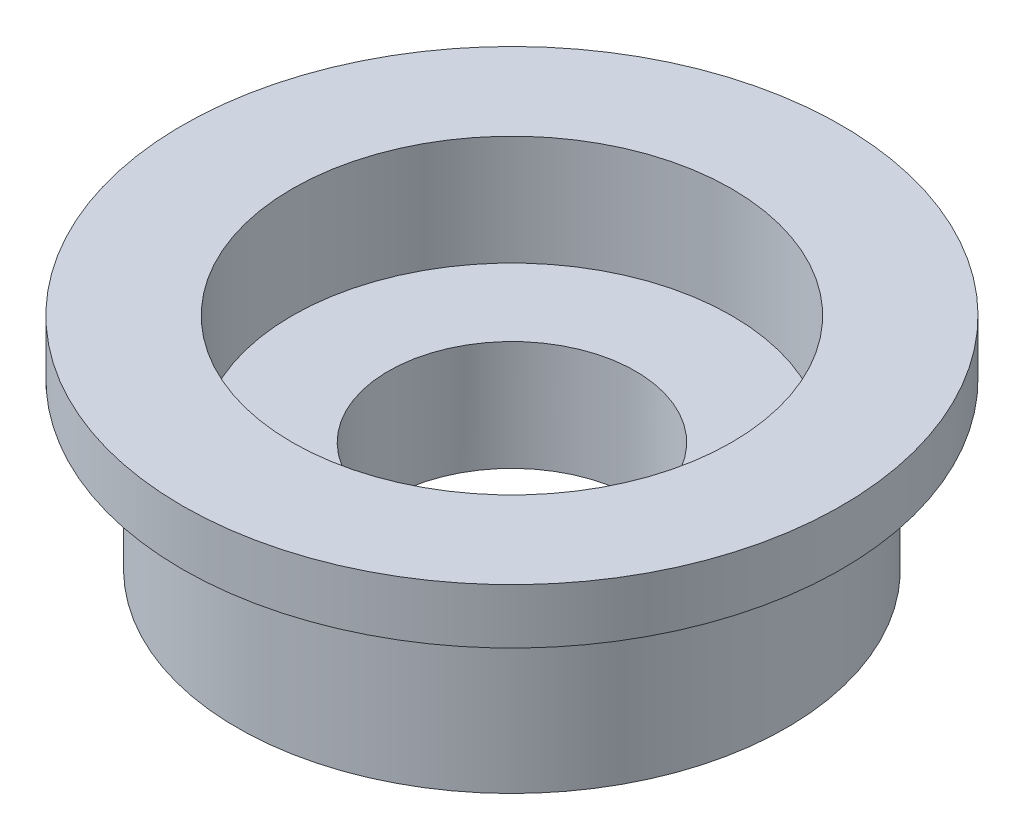
ISO-10303-21;
HEADER;
FILE_DESCRIPTION(('STEP AP214'),'2;1');
FILE_NAME('part.step','',(''),(''),'','','');
FILE_SCHEMA(('AUTOMOTIVE_DESIGN { 1 0 10303 214 1 1 1 1 }'));
ENDSEC;
DATA;
#1=APPLICATION_CONTEXT('core data for automotive mechanical design processes');
#2=APPLICATION_PROTOCOL_DEFINITION('international standard','automotive_design',2000,#1);
#3=PRODUCT_CONTEXT('',#1,'mechanical');
#4=PRODUCT('Part','Part','',(#3));
#5=PRODUCT_RELATED_PRODUCT_CATEGORY('part','',(#4));
#6=PRODUCT_DEFINITION_FORMATION('','',#4);
#7=PRODUCT_DEFINITION_CONTEXT('part definition',#1,'design');
#8=PRODUCT_DEFINITION('design','',#6,#7);
#9=PRODUCT_DEFINITION_SHAPE('','',#8);
#10=(LENGTH_UNIT() NAMED_UNIT(*) SI_UNIT(.MILLI.,.METRE.));
#11=(NAMED_UNIT(*) PLANE_ANGLE_UNIT() SI_UNIT($,.RADIAN.));
#12=(NAMED_UNIT(*) SI_UNIT($,.STERADIAN.) SOLID_ANGLE_UNIT());
#13=UNCERTAINTY_MEASURE_WITH_UNIT(LENGTH_MEASURE(1.E-05),#10,'distance_accuracy_value','');
#14=(GEOMETRIC_REPRESENTATION_CONTEXT(3) GLOBAL_UNCERTAINTY_ASSIGNED_CONTEXT((#13)) GLOBAL_UNIT_ASSIGNED_CONTEXT((#10,
#11,#12)) REPRESENTATION_CONTEXT('',''));
#15=CARTESIAN_POINT('',(0.,0.,0.));
#16=DIRECTION('',(0.,0.,1.));
#17=DIRECTION('',(1.,0.,0.));
#18=AXIS2_PLACEMENT_3D('',#15,#16,#17);
#19=CARTESIAN_POINT('',(0.,1.,0.));
#20=DIRECTION('',(0.,-1.,0.));
#21=DIRECTION('',(0.,0.,-1.));
#22=AXIS2_PLACEMENT_3D('',#19,#20,#21);
#23=CYLINDRICAL_SURFACE('',#22,6.);
#24=CARTESIAN_POINT('',(0.,1.,0.));
#25=DIRECTION('',(0.,1.,0.));
#26=DIRECTION('',(0.,0.,1.));
#27=AXIS2_PLACEMENT_3D('',#24,#25,#26);
#28=CIRCLE('',#27,6.);
#29=CARTESIAN_POINT('',(0.,1.,6.));
#30=VERTEX_POINT('',#29);
#31=EDGE_CURVE('E44',#30,#30,#28,.T.);
#32=ORIENTED_EDGE('',*,*,#31,.F.);
#33=EDGE_LOOP('',(#32));
#34=FACE_BOUND('',#33,.T.);
#35=CARTESIAN_POINT('',(0.,0.,0.));
#36=DIRECTION('',(0.,1.,0.));
#37=DIRECTION('',(0.,0.,1.));
#38=AXIS2_PLACEMENT_3D('',#35,#36,#37);
#39=CIRCLE('',#38,6.);
#40=CARTESIAN_POINT('',(0.,0.,6.));
#41=VERTEX_POINT('',#40);
#42=EDGE_CURVE('E50',#41,#41,#39,.T.);
#43=ORIENTED_EDGE('',*,*,#42,.T.);
#44=EDGE_LOOP('',(#43));
#45=FACE_BOUND('',#44,.T.);
#46=ADVANCED_FACE('F36',(#34,#45),#23,.T.);
#47=CARTESIAN_POINT('',(0.,1.,0.));
#48=DIRECTION('',(0.,1.,0.));
#49=DIRECTION('',(0.,0.,1.));
#50=AXIS2_PLACEMENT_3D('',#47,#48,#49);
#51=PLANE('',#50);
#52=CARTESIAN_POINT('',(0.,1.,0.));
#53=DIRECTION('',(0.,1.,0.));
#54=DIRECTION('',(0.,0.,1.));
#55=AXIS2_PLACEMENT_3D('',#52,#53,#54);
#56=CIRCLE('',#55,4.);
#57=CARTESIAN_POINT('',(0.,1.,4.));
#58=VERTEX_POINT('',#57);
#59=EDGE_CURVE('E66',#58,#58,#56,.T.);
#60=ORIENTED_EDGE('',*,*,#59,.F.);
#61=EDGE_LOOP('',(#60));
#62=FACE_BOUND('',#61,.T.);
#63=ORIENTED_EDGE('',*,*,#31,.T.);
#64=EDGE_LOOP('',(#63));
#65=FACE_BOUND('',#64,.T.);
#66=ADVANCED_FACE('F102',(#62,#65),#51,.T.);
#67=CARTESIAN_POINT('',(0.,0.,0.));
#68=DIRECTION('',(0.,1.,0.));
#69=DIRECTION('',(0.,0.,1.));
#70=AXIS2_PLACEMENT_3D('',#67,#68,#69);
#71=PLANE('',#70);
#72=CARTESIAN_POINT('',(0.,0.,0.));
#73=DIRECTION('',(0.,-1.,0.));
#74=DIRECTION('',(0.,0.,-1.));
#75=AXIS2_PLACEMENT_3D('',#72,#73,#74);
#76=CIRCLE('',#75,5.);
#77=CARTESIAN_POINT('',(0.,0.,-5.));
#78=VERTEX_POINT('',#77);
#79=EDGE_CURVE('E10',#78,#78,#76,.T.);
#80=ORIENTED_EDGE('',*,*,#79,.F.);
#81=EDGE_LOOP('',(#80));
#82=FACE_BOUND('',#81,.T.);
#83=ORIENTED_EDGE('',*,*,#42,.F.);
#84=EDGE_LOOP('',(#83));
#85=FACE_BOUND('',#84,.T.);
#86=ADVANCED_FACE('F98',(#82,#85),#71,.F.);
#87=CARTESIAN_POINT('',(0.,-3.,0.));
#88=DIRECTION('',(0.,1.,0.));
#89=DIRECTION('',(0.,0.,1.));
#90=AXIS2_PLACEMENT_3D('',#87,#88,#89);
#91=CYLINDRICAL_SURFACE('',#90,5.);
#92=CARTESIAN_POINT('',(0.,-3.,0.));
#93=DIRECTION('',(0.,-1.,0.));
#94=DIRECTION('',(0.,0.,-1.));
#95=AXIS2_PLACEMENT_3D('',#92,#93,#94);
#96=CIRCLE('',#95,5.);
#97=CARTESIAN_POINT('',(0.,-3.,-5.));
#98=VERTEX_POINT('',#97);
#99=EDGE_CURVE('E53',#98,#98,#96,.T.);
#100=ORIENTED_EDGE('',*,*,#99,.F.);
#101=EDGE_LOOP('',(#100));
#102=FACE_BOUND('',#101,.T.);
#103=ORIENTED_EDGE('',*,*,#79,.T.);
#104=EDGE_LOOP('',(#103));
#105=FACE_BOUND('',#104,.T.);
#106=ADVANCED_FACE('F87',(#102,#105),#91,.T.);
#107=CARTESIAN_POINT('',(0.,-3.,0.));
#108=DIRECTION('',(0.,-1.,0.));
#109=DIRECTION('',(0.,0.,-1.));
#110=AXIS2_PLACEMENT_3D('',#107,#108,#109);
#111=PLANE('',#110);
#112=CARTESIAN_POINT('',(0.,-3.,0.));
#113=DIRECTION('',(0.,-1.,0.));
#114=DIRECTION('',(0.,0.,-1.));
#115=AXIS2_PLACEMENT_3D('',#112,#113,#114);
#116=CIRCLE('',#115,2.25);
#117=CARTESIAN_POINT('',(0.,-3.,-2.25));
#118=VERTEX_POINT('',#117);
#119=EDGE_CURVE('E39',#118,#118,#116,.T.);
#120=ORIENTED_EDGE('',*,*,#119,.F.);
#121=EDGE_LOOP('',(#120));
#122=FACE_BOUND('',#121,.T.);
#123=ORIENTED_EDGE('',*,*,#99,.T.);
#124=EDGE_LOOP('',(#123));
#125=FACE_BOUND('',#124,.T.);
#126=ADVANCED_FACE('F84',(#122,#125),#111,.T.);
#127=CARTESIAN_POINT('',(0.,-1.,0.));
#128=DIRECTION('',(0.,1.,0.));
#129=DIRECTION('',(0.,0.,1.));
#130=AXIS2_PLACEMENT_3D('',#127,#128,#129);
#131=CYLINDRICAL_SURFACE('',#130,4.);
#132=CARTESIAN_POINT('',(0.,-1.,0.));
#133=DIRECTION('',(0.,1.,0.));
#134=DIRECTION('',(0.,0.,1.));
#135=AXIS2_PLACEMENT_3D('',#132,#133,#134);
#136=CIRCLE('',#135,4.);
#137=CARTESIAN_POINT('',(0.,-1.,4.));
#138=VERTEX_POINT('',#137);
#139=EDGE_CURVE('E61',#138,#138,#136,.T.);
#140=ORIENTED_EDGE('',*,*,#139,.F.);
#141=EDGE_LOOP('',(#140));
#142=FACE_BOUND('',#141,.T.);
#143=ORIENTED_EDGE('',*,*,#59,.T.);
#144=EDGE_LOOP('',(#143));
#145=FACE_BOUND('',#144,.T.);
#146=ADVANCED_FACE('F86',(#142,#145),#131,.F.);
#147=CARTESIAN_POINT('',(0.,-1.,0.));
#148=DIRECTION('',(0.,1.,0.));
#149=DIRECTION('',(0.,0.,1.));
#150=AXIS2_PLACEMENT_3D('',#147,#148,#149);
#151=PLANE('',#150);
#152=CARTESIAN_POINT('',(0.,-1.,0.));
#153=DIRECTION('',(0.,1.,0.));
#154=DIRECTION('',(0.,0.,1.));
#155=AXIS2_PLACEMENT_3D('',#152,#153,#154);
#156=CIRCLE('',#155,2.25);
#157=CARTESIAN_POINT('',(0.,-1.,2.25));
#158=VERTEX_POINT('',#157);
#159=EDGE_CURVE('E73',#158,#158,#156,.T.);
#160=ORIENTED_EDGE('',*,*,#159,.F.);
#161=EDGE_LOOP('',(#160));
#162=FACE_BOUND('',#161,.T.);
#163=ORIENTED_EDGE('',*,*,#139,.T.);
#164=EDGE_LOOP('',(#163));
#165=FACE_BOUND('',#164,.T.);
#166=ADVANCED_FACE('F94',(#162,#165),#151,.T.);
#167=CARTESIAN_POINT('',(0.,-11.,0.));
#168=DIRECTION('',(0.,1.,0.));
#169=DIRECTION('',(0.,0.,1.));
#170=AXIS2_PLACEMENT_3D('',#167,#168,#169);
#171=CYLINDRICAL_SURFACE('',#170,2.25);
#172=ORIENTED_EDGE('',*,*,#119,.T.);
#173=EDGE_LOOP('',(#172));
#174=FACE_BOUND('',#173,.T.);
#175=ORIENTED_EDGE('',*,*,#159,.T.);
#176=EDGE_LOOP('',(#175));
#177=FACE_BOUND('',#176,.T.);
#178=ADVANCED_FACE('F82',(#174,#177),#171,.F.);
#179=CLOSED_SHELL('',(#46,#66,#86,#106,#126,#146,#166,#178));
#180=MANIFOLD_SOLID_BREP('B2',#179);
#181=ADVANCED_BREP_SHAPE_REPRESENTATION('',(#18,#180),#14);
#182=SHAPE_DEFINITION_REPRESENTATION(#9,#181);
ENDSEC;
END-ISO-10303-21;
